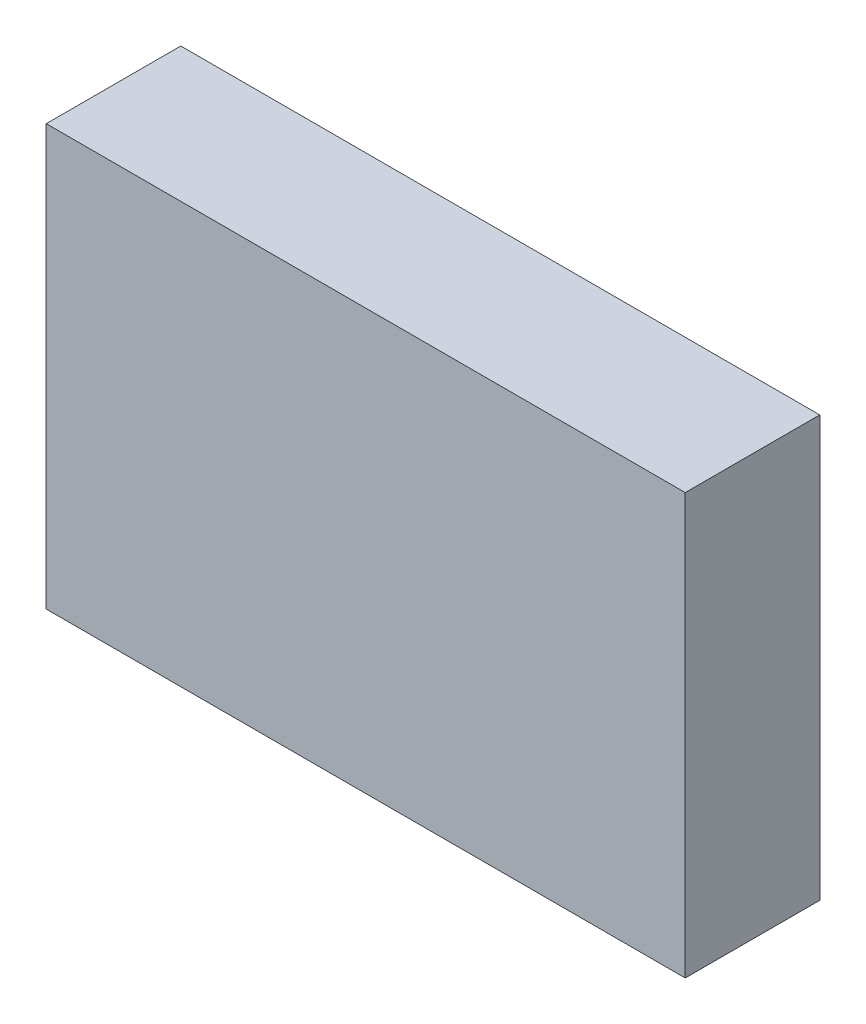
ISO-10303-21;
HEADER;
FILE_DESCRIPTION(('STEP AP214'),'2;1');
FILE_NAME('part.step','',(''),(''),'','','');
FILE_SCHEMA(('AUTOMOTIVE_DESIGN { 1 0 10303 214 1 1 1 1 }'));
ENDSEC;
DATA;
#1=APPLICATION_CONTEXT('core data for automotive mechanical design processes');
#2=APPLICATION_PROTOCOL_DEFINITION('international standard','automotive_design',2000,#1);
#3=PRODUCT_CONTEXT('',#1,'mechanical');
#4=PRODUCT('Part','Part','',(#3));
#5=PRODUCT_RELATED_PRODUCT_CATEGORY('part','',(#4));
#6=PRODUCT_DEFINITION_FORMATION('','',#4);
#7=PRODUCT_DEFINITION_CONTEXT('part definition',#1,'design');
#8=PRODUCT_DEFINITION('design','',#6,#7);
#9=PRODUCT_DEFINITION_SHAPE('','',#8);
#10=(LENGTH_UNIT() NAMED_UNIT(*) SI_UNIT(.MILLI.,.METRE.));
#11=(NAMED_UNIT(*) PLANE_ANGLE_UNIT() SI_UNIT($,.RADIAN.));
#12=(NAMED_UNIT(*) SI_UNIT($,.STERADIAN.) SOLID_ANGLE_UNIT());
#13=UNCERTAINTY_MEASURE_WITH_UNIT(LENGTH_MEASURE(1.E-05),#10,'distance_accuracy_value','');
#14=(GEOMETRIC_REPRESENTATION_CONTEXT(3) GLOBAL_UNCERTAINTY_ASSIGNED_CONTEXT((#13)) GLOBAL_UNIT_ASSIGNED_CONTEXT((#10,
#11,#12)) REPRESENTATION_CONTEXT('',''));
#15=CARTESIAN_POINT('',(0.,0.,0.));
#16=DIRECTION('',(0.,0.,1.));
#17=DIRECTION('',(1.,0.,0.));
#18=AXIS2_PLACEMENT_3D('',#15,#16,#17);
#19=CARTESIAN_POINT('',(0.,0.,0.4));
#20=DIRECTION('',(0.,0.,1.));
#21=DIRECTION('',(1.,0.,0.));
#22=AXIS2_PLACEMENT_3D('',#19,#20,#21);
#23=PLANE('',#22);
#24=DIRECTION('',(-1.,0.,0.));
#25=VECTOR('',#24,1.);
#26=CARTESIAN_POINT('',(-0.95,0.625,0.4));
#27=LINE('',#26,#25);
#28=CARTESIAN_POINT('',(0.95,0.625,0.4));
#29=VERTEX_POINT('',#28);
#30=CARTESIAN_POINT('',(-0.95,0.625,0.4));
#31=VERTEX_POINT('',#30);
#32=EDGE_CURVE('E11',#29,#31,#27,.T.);
#33=ORIENTED_EDGE('',*,*,#32,.T.);
#34=DIRECTION('',(0.,-1.,0.));
#35=VECTOR('',#34,1.);
#36=CARTESIAN_POINT('',(-0.95,-0.625,0.4));
#37=LINE('',#36,#35);
#38=CARTESIAN_POINT('',(-0.95,-0.625,0.4));
#39=VERTEX_POINT('',#38);
#40=EDGE_CURVE('E76',#31,#39,#37,.T.);
#41=ORIENTED_EDGE('',*,*,#40,.T.);
#42=DIRECTION('',(1.,0.,0.));
#43=VECTOR('',#42,1.);
#44=CARTESIAN_POINT('',(0.95,-0.625,0.4));
#45=LINE('',#44,#43);
#46=CARTESIAN_POINT('',(0.95,-0.625,0.4));
#47=VERTEX_POINT('',#46);
#48=EDGE_CURVE('E70',#39,#47,#45,.T.);
#49=ORIENTED_EDGE('',*,*,#48,.T.);
#50=DIRECTION('',(0.,1.,0.));
#51=VECTOR('',#50,1.);
#52=CARTESIAN_POINT('',(0.95,0.625,0.4));
#53=LINE('',#52,#51);
#54=EDGE_CURVE('E73',#47,#29,#53,.T.);
#55=ORIENTED_EDGE('',*,*,#54,.T.);
#56=EDGE_LOOP('',(#33,#41,#49,#55));
#57=FACE_BOUND('',#56,.T.);
#58=ADVANCED_FACE('F17',(#57),#23,.T.);
#59=CARTESIAN_POINT('',(0.,0.,0.));
#60=DIRECTION('',(0.,0.,1.));
#61=DIRECTION('',(1.,0.,0.));
#62=AXIS2_PLACEMENT_3D('',#59,#60,#61);
#63=PLANE('',#62);
#64=DIRECTION('',(1.,0.,0.));
#65=VECTOR('',#64,1.);
#66=CARTESIAN_POINT('',(-0.95,0.625,0.));
#67=LINE('',#66,#65);
#68=CARTESIAN_POINT('',(-0.95,0.625,0.));
#69=VERTEX_POINT('',#68);
#70=CARTESIAN_POINT('',(0.95,0.625,0.));
#71=VERTEX_POINT('',#70);
#72=EDGE_CURVE('E27',#69,#71,#67,.T.);
#73=ORIENTED_EDGE('',*,*,#72,.T.);
#74=DIRECTION('',(0.,-1.,0.));
#75=VECTOR('',#74,1.);
#76=CARTESIAN_POINT('',(0.95,0.625,0.));
#77=LINE('',#76,#75);
#78=CARTESIAN_POINT('',(0.95,-0.625,0.));
#79=VERTEX_POINT('',#78);
#80=EDGE_CURVE('E97',#71,#79,#77,.T.);
#81=ORIENTED_EDGE('',*,*,#80,.T.);
#82=DIRECTION('',(-1.,0.,0.));
#83=VECTOR('',#82,1.);
#84=CARTESIAN_POINT('',(0.95,-0.625,0.));
#85=LINE('',#84,#83);
#86=CARTESIAN_POINT('',(-0.95,-0.625,0.));
#87=VERTEX_POINT('',#86);
#88=EDGE_CURVE('E80',#79,#87,#85,.T.);
#89=ORIENTED_EDGE('',*,*,#88,.T.);
#90=DIRECTION('',(0.,1.,0.));
#91=VECTOR('',#90,1.);
#92=CARTESIAN_POINT('',(-0.95,-0.625,0.));
#93=LINE('',#92,#91);
#94=EDGE_CURVE('E20',#87,#69,#93,.T.);
#95=ORIENTED_EDGE('',*,*,#94,.T.);
#96=EDGE_LOOP('',(#73,#81,#89,#95));
#97=FACE_BOUND('',#96,.T.);
#98=ADVANCED_FACE('F114',(#97),#63,.F.);
#99=CARTESIAN_POINT('',(0.95,0.625,0.));
#100=DIRECTION('',(0.,1.,0.));
#101=DIRECTION('',(1.,0.,0.));
#102=AXIS2_PLACEMENT_3D('',#99,#100,#101);
#103=PLANE('',#102);
#104=ORIENTED_EDGE('',*,*,#72,.F.);
#105=DIRECTION('',(0.,0.,1.));
#106=VECTOR('',#105,1.);
#107=CARTESIAN_POINT('',(-0.95,0.625,0.));
#108=LINE('',#107,#106);
#109=EDGE_CURVE('E102',#69,#31,#108,.T.);
#110=ORIENTED_EDGE('',*,*,#109,.T.);
#111=ORIENTED_EDGE('',*,*,#32,.F.);
#112=DIRECTION('',(0.,0.,1.));
#113=VECTOR('',#112,1.);
#114=CARTESIAN_POINT('',(0.95,0.625,0.));
#115=LINE('',#114,#113);
#116=EDGE_CURVE('E92',#71,#29,#115,.T.);
#117=ORIENTED_EDGE('',*,*,#116,.F.);
#118=EDGE_LOOP('',(#104,#110,#111,#117));
#119=FACE_BOUND('',#118,.T.);
#120=ADVANCED_FACE('F116',(#119),#103,.T.);
#121=CARTESIAN_POINT('',(-0.95,0.625,0.));
#122=DIRECTION('',(-1.,0.,0.));
#123=DIRECTION('',(0.,0.,1.));
#124=AXIS2_PLACEMENT_3D('',#121,#122,#123);
#125=PLANE('',#124);
#126=ORIENTED_EDGE('',*,*,#94,.F.);
#127=DIRECTION('',(0.,0.,1.));
#128=VECTOR('',#127,1.);
#129=CARTESIAN_POINT('',(-0.95,-0.625,0.));
#130=LINE('',#129,#128);
#131=EDGE_CURVE('E79',#87,#39,#130,.T.);
#132=ORIENTED_EDGE('',*,*,#131,.T.);
#133=ORIENTED_EDGE('',*,*,#40,.F.);
#134=ORIENTED_EDGE('',*,*,#109,.F.);
#135=EDGE_LOOP('',(#126,#132,#133,#134));
#136=FACE_BOUND('',#135,.T.);
#137=ADVANCED_FACE('F117',(#136),#125,.T.);
#138=CARTESIAN_POINT('',(-0.95,-0.625,0.));
#139=DIRECTION('',(0.,-1.,0.));
#140=DIRECTION('',(0.,0.,-1.));
#141=AXIS2_PLACEMENT_3D('',#138,#139,#140);
#142=PLANE('',#141);
#143=ORIENTED_EDGE('',*,*,#88,.F.);
#144=DIRECTION('',(0.,0.,1.));
#145=VECTOR('',#144,1.);
#146=CARTESIAN_POINT('',(0.95,-0.625,0.));
#147=LINE('',#146,#145);
#148=EDGE_CURVE('E83',#79,#47,#147,.T.);
#149=ORIENTED_EDGE('',*,*,#148,.T.);
#150=ORIENTED_EDGE('',*,*,#48,.F.);
#151=ORIENTED_EDGE('',*,*,#131,.F.);
#152=EDGE_LOOP('',(#143,#149,#150,#151));
#153=FACE_BOUND('',#152,.T.);
#154=ADVANCED_FACE('F84',(#153),#142,.T.);
#155=CARTESIAN_POINT('',(0.95,-0.625,0.));
#156=DIRECTION('',(1.,0.,0.));
#157=DIRECTION('',(0.,1.,0.));
#158=AXIS2_PLACEMENT_3D('',#155,#156,#157);
#159=PLANE('',#158);
#160=ORIENTED_EDGE('',*,*,#80,.F.);
#161=ORIENTED_EDGE('',*,*,#116,.T.);
#162=ORIENTED_EDGE('',*,*,#54,.F.);
#163=ORIENTED_EDGE('',*,*,#148,.F.);
#164=EDGE_LOOP('',(#160,#161,#162,#163));
#165=FACE_BOUND('',#164,.T.);
#166=ADVANCED_FACE('F90',(#165),#159,.T.);
#167=CLOSED_SHELL('',(#58,#98,#120,#137,#154,#166));
#168=MANIFOLD_SOLID_BREP('B1',#167);
#169=ADVANCED_BREP_SHAPE_REPRESENTATION('',(#18,#168),#14);
#170=SHAPE_DEFINITION_REPRESENTATION(#9,#169);
ENDSEC;
END-ISO-10303-21;
